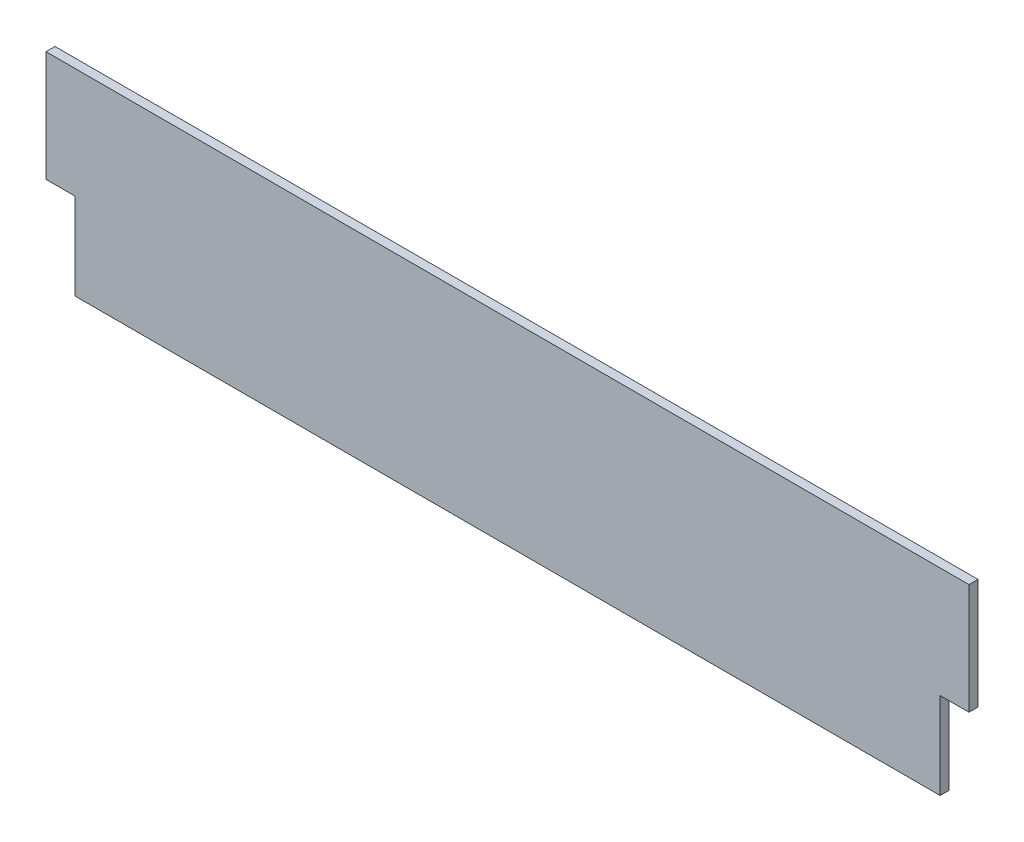
ISO-10303-21;
HEADER;
FILE_DESCRIPTION(('STEP AP214'),'2;1');
FILE_NAME('part.step','',(''),(''),'','','');
FILE_SCHEMA(('AUTOMOTIVE_DESIGN { 1 0 10303 214 1 1 1 1 }'));
ENDSEC;
DATA;
#1=APPLICATION_CONTEXT('core data for automotive mechanical design processes');
#2=APPLICATION_PROTOCOL_DEFINITION('international standard','automotive_design',2000,#1);
#3=PRODUCT_CONTEXT('',#1,'mechanical');
#4=PRODUCT('Part','Part','',(#3));
#5=PRODUCT_RELATED_PRODUCT_CATEGORY('part','',(#4));
#6=PRODUCT_DEFINITION_FORMATION('','',#4);
#7=PRODUCT_DEFINITION_CONTEXT('part definition',#1,'design');
#8=PRODUCT_DEFINITION('design','',#6,#7);
#9=PRODUCT_DEFINITION_SHAPE('','',#8);
#10=(LENGTH_UNIT() NAMED_UNIT(*) SI_UNIT(.MILLI.,.METRE.));
#11=(NAMED_UNIT(*) PLANE_ANGLE_UNIT() SI_UNIT($,.RADIAN.));
#12=(NAMED_UNIT(*) SI_UNIT($,.STERADIAN.) SOLID_ANGLE_UNIT());
#13=UNCERTAINTY_MEASURE_WITH_UNIT(LENGTH_MEASURE(1.E-05),#10,'distance_accuracy_value','');
#14=(GEOMETRIC_REPRESENTATION_CONTEXT(3) GLOBAL_UNCERTAINTY_ASSIGNED_CONTEXT((#13)) GLOBAL_UNIT_ASSIGNED_CONTEXT((#10,
#11,#12)) REPRESENTATION_CONTEXT('',''));
#15=CARTESIAN_POINT('',(0.,0.,0.));
#16=DIRECTION('',(0.,0.,1.));
#17=DIRECTION('',(1.,0.,0.));
#18=AXIS2_PLACEMENT_3D('',#15,#16,#17);
#19=CARTESIAN_POINT('',(1193.85366625471,-57.15,11.90625));
#20=DIRECTION('',(-1.,0.,0.));
#21=DIRECTION('',(0.,0.,1.));
#22=AXIS2_PLACEMENT_3D('',#19,#20,#21);
#23=PLANE('',#22);
#24=DIRECTION('',(0.,1.,0.));
#25=VECTOR('',#24,1.);
#26=CARTESIAN_POINT('',(1193.85366625471,-57.15,0.));
#27=LINE('',#26,#25);
#28=CARTESIAN_POINT('',(1193.85366625471,-57.15,0.));
#29=VERTEX_POINT('',#28);
#30=CARTESIAN_POINT('',(1193.85366625471,57.15,0.));
#31=VERTEX_POINT('',#30);
#32=EDGE_CURVE('E128',#29,#31,#27,.T.);
#33=ORIENTED_EDGE('',*,*,#32,.T.);
#34=DIRECTION('',(0.,0.,-1.));
#35=VECTOR('',#34,1.);
#36=CARTESIAN_POINT('',(1193.85366625471,57.15,11.90625));
#37=LINE('',#36,#35);
#38=CARTESIAN_POINT('',(1193.85366625471,57.15,11.90625));
#39=VERTEX_POINT('',#38);
#40=EDGE_CURVE('E11',#39,#31,#37,.T.);
#41=ORIENTED_EDGE('',*,*,#40,.F.);
#42=DIRECTION('',(0.,1.,0.));
#43=VECTOR('',#42,1.);
#44=CARTESIAN_POINT('',(1193.85366625471,-57.15,11.90625));
#45=LINE('',#44,#43);
#46=CARTESIAN_POINT('',(1193.85366625471,-57.15,11.90625));
#47=VERTEX_POINT('',#46);
#48=EDGE_CURVE('E142',#47,#39,#45,.T.);
#49=ORIENTED_EDGE('',*,*,#48,.F.);
#50=DIRECTION('',(0.,0.,-1.));
#51=VECTOR('',#50,1.);
#52=CARTESIAN_POINT('',(1193.85366625471,-57.15,11.90625));
#53=LINE('',#52,#51);
#54=EDGE_CURVE('E124',#47,#29,#53,.T.);
#55=ORIENTED_EDGE('',*,*,#54,.T.);
#56=EDGE_LOOP('',(#33,#41,#49,#55));
#57=FACE_BOUND('',#56,.T.);
#58=ADVANCED_FACE('F32',(#57),#23,.F.);
#59=CARTESIAN_POINT('',(1231.95366625471,57.15,11.90625));
#60=DIRECTION('',(0.,1.,0.));
#61=DIRECTION('',(-1.,0.,0.));
#62=AXIS2_PLACEMENT_3D('',#59,#60,#61);
#63=PLANE('',#62);
#64=DIRECTION('',(1.,0.,0.));
#65=VECTOR('',#64,1.);
#66=CARTESIAN_POINT('',(1231.95366625471,57.15,0.));
#67=LINE('',#66,#65);
#68=CARTESIAN_POINT('',(1231.95366625471,57.15,0.));
#69=VERTEX_POINT('',#68);
#70=EDGE_CURVE('E131',#31,#69,#67,.T.);
#71=ORIENTED_EDGE('',*,*,#70,.T.);
#72=DIRECTION('',(0.,0.,-1.));
#73=VECTOR('',#72,1.);
#74=CARTESIAN_POINT('',(1231.95366625471,57.15,11.90625));
#75=LINE('',#74,#73);
#76=CARTESIAN_POINT('',(1231.95366625471,57.15,11.90625));
#77=VERTEX_POINT('',#76);
#78=EDGE_CURVE('E40',#77,#69,#75,.T.);
#79=ORIENTED_EDGE('',*,*,#78,.F.);
#80=DIRECTION('',(1.,0.,0.));
#81=VECTOR('',#80,1.);
#82=CARTESIAN_POINT('',(1231.95366625471,57.15,11.90625));
#83=LINE('',#82,#81);
#84=EDGE_CURVE('E91',#39,#77,#83,.T.);
#85=ORIENTED_EDGE('',*,*,#84,.F.);
#86=ORIENTED_EDGE('',*,*,#40,.T.);
#87=EDGE_LOOP('',(#71,#79,#85,#86));
#88=FACE_BOUND('',#87,.T.);
#89=ADVANCED_FACE('F177',(#88),#63,.F.);
#90=CARTESIAN_POINT('',(1231.95366625471,57.15,11.90625));
#91=DIRECTION('',(-1.,0.,0.));
#92=DIRECTION('',(0.,0.,1.));
#93=AXIS2_PLACEMENT_3D('',#90,#91,#92);
#94=PLANE('',#93);
#95=DIRECTION('',(0.,1.,0.));
#96=VECTOR('',#95,1.);
#97=CARTESIAN_POINT('',(1231.95366625471,57.15,0.));
#98=LINE('',#97,#96);
#99=CARTESIAN_POINT('',(1231.95366625471,203.2,0.));
#100=VERTEX_POINT('',#99);
#101=EDGE_CURVE('E133',#69,#100,#98,.T.);
#102=ORIENTED_EDGE('',*,*,#101,.T.);
#103=DIRECTION('',(0.,0.,-1.));
#104=VECTOR('',#103,1.);
#105=CARTESIAN_POINT('',(1231.95366625471,203.2,11.90625));
#106=LINE('',#105,#104);
#107=CARTESIAN_POINT('',(1231.95366625471,203.2,11.90625));
#108=VERTEX_POINT('',#107);
#109=EDGE_CURVE('E149',#108,#100,#106,.T.);
#110=ORIENTED_EDGE('',*,*,#109,.F.);
#111=DIRECTION('',(0.,1.,0.));
#112=VECTOR('',#111,1.);
#113=CARTESIAN_POINT('',(1231.95366625471,57.15,11.90625));
#114=LINE('',#113,#112);
#115=EDGE_CURVE('E157',#77,#108,#114,.T.);
#116=ORIENTED_EDGE('',*,*,#115,.F.);
#117=ORIENTED_EDGE('',*,*,#78,.T.);
#118=EDGE_LOOP('',(#102,#110,#116,#117));
#119=FACE_BOUND('',#118,.T.);
#120=ADVANCED_FACE('F155',(#119),#94,.F.);
#121=CARTESIAN_POINT('',(12.7536662547098,203.2,11.90625));
#122=DIRECTION('',(0.,-1.,0.));
#123=DIRECTION('',(0.,0.,-1.));
#124=AXIS2_PLACEMENT_3D('',#121,#122,#123);
#125=PLANE('',#124);
#126=DIRECTION('',(-1.,0.,0.));
#127=VECTOR('',#126,1.);
#128=CARTESIAN_POINT('',(12.7536662547098,203.2,0.));
#129=LINE('',#128,#127);
#130=CARTESIAN_POINT('',(12.7536662547098,203.2,0.));
#131=VERTEX_POINT('',#130);
#132=EDGE_CURVE('E135',#100,#131,#129,.T.);
#133=ORIENTED_EDGE('',*,*,#132,.T.);
#134=DIRECTION('',(0.,0.,-1.));
#135=VECTOR('',#134,1.);
#136=CARTESIAN_POINT('',(12.7536662547098,203.2,11.90625));
#137=LINE('',#136,#135);
#138=CARTESIAN_POINT('',(12.7536662547098,203.2,11.90625));
#139=VERTEX_POINT('',#138);
#140=EDGE_CURVE('E146',#139,#131,#137,.T.);
#141=ORIENTED_EDGE('',*,*,#140,.F.);
#142=DIRECTION('',(-1.,0.,0.));
#143=VECTOR('',#142,1.);
#144=CARTESIAN_POINT('',(12.7536662547098,203.2,11.90625));
#145=LINE('',#144,#143);
#146=EDGE_CURVE('E169',#108,#139,#145,.T.);
#147=ORIENTED_EDGE('',*,*,#146,.F.);
#148=ORIENTED_EDGE('',*,*,#109,.T.);
#149=EDGE_LOOP('',(#133,#141,#147,#148));
#150=FACE_BOUND('',#149,.T.);
#151=ADVANCED_FACE('F165',(#150),#125,.F.);
#152=CARTESIAN_POINT('',(12.7536662547098,57.15,11.90625));
#153=DIRECTION('',(1.,0.,0.));
#154=DIRECTION('',(0.,1.,0.));
#155=AXIS2_PLACEMENT_3D('',#152,#153,#154);
#156=PLANE('',#155);
#157=DIRECTION('',(0.,-1.,0.));
#158=VECTOR('',#157,1.);
#159=CARTESIAN_POINT('',(12.7536662547098,57.15,0.));
#160=LINE('',#159,#158);
#161=CARTESIAN_POINT('',(12.7536662547098,57.15,0.));
#162=VERTEX_POINT('',#161);
#163=EDGE_CURVE('E137',#131,#162,#160,.T.);
#164=ORIENTED_EDGE('',*,*,#163,.T.);
#165=DIRECTION('',(0.,0.,-1.));
#166=VECTOR('',#165,1.);
#167=CARTESIAN_POINT('',(12.7536662547098,57.15,11.90625));
#168=LINE('',#167,#166);
#169=CARTESIAN_POINT('',(12.7536662547098,57.15,11.90625));
#170=VERTEX_POINT('',#169);
#171=EDGE_CURVE('E119',#170,#162,#168,.T.);
#172=ORIENTED_EDGE('',*,*,#171,.F.);
#173=DIRECTION('',(0.,-1.,0.));
#174=VECTOR('',#173,1.);
#175=CARTESIAN_POINT('',(12.7536662547098,57.15,11.90625));
#176=LINE('',#175,#174);
#177=EDGE_CURVE('E110',#139,#170,#176,.T.);
#178=ORIENTED_EDGE('',*,*,#177,.F.);
#179=ORIENTED_EDGE('',*,*,#140,.T.);
#180=EDGE_LOOP('',(#164,#172,#178,#179));
#181=FACE_BOUND('',#180,.T.);
#182=ADVANCED_FACE('F168',(#181),#156,.F.);
#183=CARTESIAN_POINT('',(12.7536662547098,57.15,11.90625));
#184=DIRECTION('',(0.,1.,0.));
#185=DIRECTION('',(0.,0.,1.));
#186=AXIS2_PLACEMENT_3D('',#183,#184,#185);
#187=PLANE('',#186);
#188=DIRECTION('',(1.,0.,0.));
#189=VECTOR('',#188,1.);
#190=CARTESIAN_POINT('',(12.7536662547098,57.15,0.));
#191=LINE('',#190,#189);
#192=CARTESIAN_POINT('',(50.8536662547099,57.15,0.));
#193=VERTEX_POINT('',#192);
#194=EDGE_CURVE('E118',#162,#193,#191,.T.);
#195=ORIENTED_EDGE('',*,*,#194,.T.);
#196=DIRECTION('',(0.,0.,-1.));
#197=VECTOR('',#196,1.);
#198=CARTESIAN_POINT('',(50.8536662547099,57.15,11.90625));
#199=LINE('',#198,#197);
#200=CARTESIAN_POINT('',(50.8536662547099,57.15,11.90625));
#201=VERTEX_POINT('',#200);
#202=EDGE_CURVE('E115',#201,#193,#199,.T.);
#203=ORIENTED_EDGE('',*,*,#202,.F.);
#204=DIRECTION('',(1.,0.,0.));
#205=VECTOR('',#204,1.);
#206=CARTESIAN_POINT('',(12.7536662547098,57.15,11.90625));
#207=LINE('',#206,#205);
#208=EDGE_CURVE('E104',#170,#201,#207,.T.);
#209=ORIENTED_EDGE('',*,*,#208,.F.);
#210=ORIENTED_EDGE('',*,*,#171,.T.);
#211=EDGE_LOOP('',(#195,#203,#209,#210));
#212=FACE_BOUND('',#211,.T.);
#213=ADVANCED_FACE('F116',(#212),#187,.F.);
#214=CARTESIAN_POINT('',(50.8536662547099,-57.15,11.90625));
#215=DIRECTION('',(1.,0.,0.));
#216=DIRECTION('',(0.,1.,0.));
#217=AXIS2_PLACEMENT_3D('',#214,#215,#216);
#218=PLANE('',#217);
#219=DIRECTION('',(0.,-1.,0.));
#220=VECTOR('',#219,1.);
#221=CARTESIAN_POINT('',(50.8536662547099,-57.15,0.));
#222=LINE('',#221,#220);
#223=CARTESIAN_POINT('',(50.8536662547099,-57.15,0.));
#224=VERTEX_POINT('',#223);
#225=EDGE_CURVE('E77',#193,#224,#222,.T.);
#226=ORIENTED_EDGE('',*,*,#225,.T.);
#227=DIRECTION('',(0.,0.,-1.));
#228=VECTOR('',#227,1.);
#229=CARTESIAN_POINT('',(50.8536662547099,-57.15,11.90625));
#230=LINE('',#229,#228);
#231=CARTESIAN_POINT('',(50.8536662547099,-57.15,11.90625));
#232=VERTEX_POINT('',#231);
#233=EDGE_CURVE('E120',#232,#224,#230,.T.);
#234=ORIENTED_EDGE('',*,*,#233,.F.);
#235=DIRECTION('',(0.,-1.,0.));
#236=VECTOR('',#235,1.);
#237=CARTESIAN_POINT('',(50.8536662547099,-57.15,11.90625));
#238=LINE('',#237,#236);
#239=EDGE_CURVE('E108',#201,#232,#238,.T.);
#240=ORIENTED_EDGE('',*,*,#239,.F.);
#241=ORIENTED_EDGE('',*,*,#202,.T.);
#242=EDGE_LOOP('',(#226,#234,#240,#241));
#243=FACE_BOUND('',#242,.T.);
#244=ADVANCED_FACE('F122',(#243),#218,.F.);
#245=CARTESIAN_POINT('',(50.8536662547099,-57.15,11.90625));
#246=DIRECTION('',(0.,1.,0.));
#247=DIRECTION('',(0.,0.,1.));
#248=AXIS2_PLACEMENT_3D('',#245,#246,#247);
#249=PLANE('',#248);
#250=DIRECTION('',(1.,0.,0.));
#251=VECTOR('',#250,1.);
#252=CARTESIAN_POINT('',(50.8536662547099,-57.15,0.));
#253=LINE('',#252,#251);
#254=EDGE_CURVE('E83',#224,#29,#253,.T.);
#255=ORIENTED_EDGE('',*,*,#254,.T.);
#256=ORIENTED_EDGE('',*,*,#54,.F.);
#257=DIRECTION('',(1.,0.,0.));
#258=VECTOR('',#257,1.);
#259=CARTESIAN_POINT('',(50.8536662547099,-57.15,11.90625));
#260=LINE('',#259,#258);
#261=EDGE_CURVE('E48',#232,#47,#260,.T.);
#262=ORIENTED_EDGE('',*,*,#261,.F.);
#263=ORIENTED_EDGE('',*,*,#233,.T.);
#264=EDGE_LOOP('',(#255,#256,#262,#263));
#265=FACE_BOUND('',#264,.T.);
#266=ADVANCED_FACE('F193',(#265),#249,.F.);
#267=CARTESIAN_POINT('',(0.,0.,11.90625));
#268=DIRECTION('',(0.,0.,1.));
#269=DIRECTION('',(1.,0.,0.));
#270=AXIS2_PLACEMENT_3D('',#267,#268,#269);
#271=PLANE('',#270);
#272=ORIENTED_EDGE('',*,*,#48,.T.);
#273=ORIENTED_EDGE('',*,*,#84,.T.);
#274=ORIENTED_EDGE('',*,*,#115,.T.);
#275=ORIENTED_EDGE('',*,*,#146,.T.);
#276=ORIENTED_EDGE('',*,*,#177,.T.);
#277=ORIENTED_EDGE('',*,*,#208,.T.);
#278=ORIENTED_EDGE('',*,*,#239,.T.);
#279=ORIENTED_EDGE('',*,*,#261,.T.);
#280=EDGE_LOOP('',(#272,#273,#274,#275,#276,#277,#278,#279));
#281=FACE_BOUND('',#280,.T.);
#282=ADVANCED_FACE('F106',(#281),#271,.T.);
#283=CARTESIAN_POINT('',(0.,0.,0.));
#284=DIRECTION('',(0.,0.,1.));
#285=DIRECTION('',(1.,0.,0.));
#286=AXIS2_PLACEMENT_3D('',#283,#284,#285);
#287=PLANE('',#286);
#288=ORIENTED_EDGE('',*,*,#32,.F.);
#289=ORIENTED_EDGE('',*,*,#254,.F.);
#290=ORIENTED_EDGE('',*,*,#225,.F.);
#291=ORIENTED_EDGE('',*,*,#194,.F.);
#292=ORIENTED_EDGE('',*,*,#163,.F.);
#293=ORIENTED_EDGE('',*,*,#132,.F.);
#294=ORIENTED_EDGE('',*,*,#101,.F.);
#295=ORIENTED_EDGE('',*,*,#70,.F.);
#296=EDGE_LOOP('',(#288,#289,#290,#291,#292,#293,#294,#295));
#297=FACE_BOUND('',#296,.T.);
#298=ADVANCED_FACE('F161',(#297),#287,.F.);
#299=CLOSED_SHELL('',(#58,#89,#120,#151,#182,#213,#244,#266,#282,#298));
#300=MANIFOLD_SOLID_BREP('B2',#299);
#301=ADVANCED_BREP_SHAPE_REPRESENTATION('',(#18,#300),#14);
#302=SHAPE_DEFINITION_REPRESENTATION(#9,#301);
ENDSEC;
END-ISO-10303-21;
